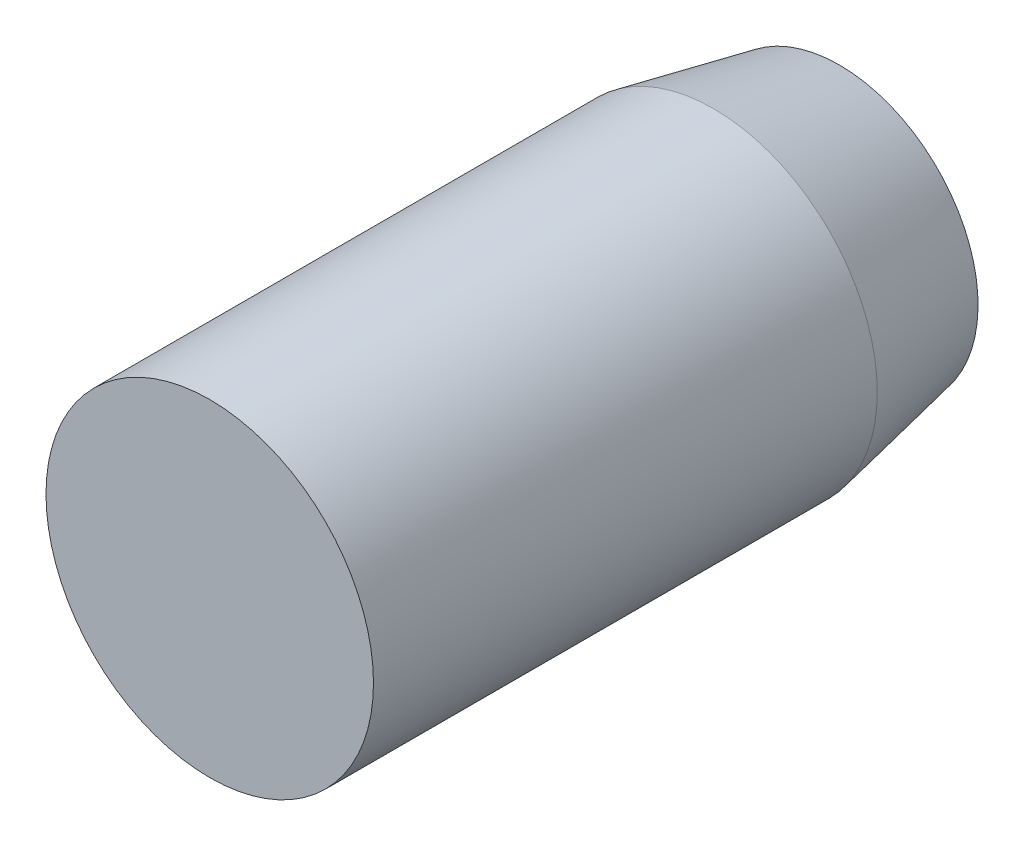
ISO-10303-21;
HEADER;
FILE_DESCRIPTION(('STEP AP214'),'2;1');
FILE_NAME('part.step','',(''),(''),'','','');
FILE_SCHEMA(('AUTOMOTIVE_DESIGN { 1 0 10303 214 1 1 1 1 }'));
ENDSEC;
DATA;
#1=APPLICATION_CONTEXT('core data for automotive mechanical design processes');
#2=APPLICATION_PROTOCOL_DEFINITION('international standard','automotive_design',2000,#1);
#3=PRODUCT_CONTEXT('',#1,'mechanical');
#4=PRODUCT('Part','Part','',(#3));
#5=PRODUCT_RELATED_PRODUCT_CATEGORY('part','',(#4));
#6=PRODUCT_DEFINITION_FORMATION('','',#4);
#7=PRODUCT_DEFINITION_CONTEXT('part definition',#1,'design');
#8=PRODUCT_DEFINITION('design','',#6,#7);
#9=PRODUCT_DEFINITION_SHAPE('','',#8);
#10=(LENGTH_UNIT() NAMED_UNIT(*) SI_UNIT(.MILLI.,.METRE.));
#11=(NAMED_UNIT(*) PLANE_ANGLE_UNIT() SI_UNIT($,.RADIAN.));
#12=(NAMED_UNIT(*) SI_UNIT($,.STERADIAN.) SOLID_ANGLE_UNIT());
#13=UNCERTAINTY_MEASURE_WITH_UNIT(LENGTH_MEASURE(1.E-05),#10,'distance_accuracy_value','');
#14=(GEOMETRIC_REPRESENTATION_CONTEXT(3) GLOBAL_UNCERTAINTY_ASSIGNED_CONTEXT((#13)) GLOBAL_UNIT_ASSIGNED_CONTEXT((#10,
#11,#12)) REPRESENTATION_CONTEXT('',''));
#15=CARTESIAN_POINT('',(0.,0.,0.));
#16=DIRECTION('',(0.,0.,1.));
#17=DIRECTION('',(1.,0.,0.));
#18=AXIS2_PLACEMENT_3D('',#15,#16,#17);
#19=CARTESIAN_POINT('',(0.,0.,0.));
#20=DIRECTION('',(0.,0.,1.));
#21=DIRECTION('',(0.,-1.,0.));
#22=AXIS2_PLACEMENT_3D('',#19,#20,#21);
#23=PLANE('',#22);
#24=CARTESIAN_POINT('',(0.,0.,0.));
#25=DIRECTION('',(0.,0.,-1.));
#26=DIRECTION('',(0.,1.,0.));
#27=AXIS2_PLACEMENT_3D('',#24,#25,#26);
#28=CIRCLE('',#27,6.5);
#29=CARTESIAN_POINT('',(0.,6.5,0.));
#30=VERTEX_POINT('',#29);
#31=EDGE_CURVE('E10',#30,#30,#28,.T.);
#32=ORIENTED_EDGE('',*,*,#31,.F.);
#33=EDGE_LOOP('',(#32));
#34=FACE_BOUND('',#33,.T.);
#35=ADVANCED_FACE('F32',(#34),#23,.T.);
#36=CARTESIAN_POINT('',(0.,0.,-25.));
#37=DIRECTION('',(0.,0.,-1.));
#38=DIRECTION('',(0.,1.,0.));
#39=AXIS2_PLACEMENT_3D('',#36,#37,#38);
#40=CYLINDRICAL_SURFACE('',#39,6.5);
#41=ORIENTED_EDGE('',*,*,#31,.T.);
#42=EDGE_LOOP('',(#41));
#43=FACE_BOUND('',#42,.T.);
#44=CARTESIAN_POINT('',(0.,0.,-20.));
#45=DIRECTION('',(0.,0.,-1.));
#46=DIRECTION('',(0.,1.,0.));
#47=AXIS2_PLACEMENT_3D('',#44,#45,#46);
#48=CIRCLE('',#47,6.5);
#49=CARTESIAN_POINT('',(0.,6.5,-20.));
#50=VERTEX_POINT('',#49);
#51=EDGE_CURVE('E38',#50,#50,#48,.T.);
#52=ORIENTED_EDGE('',*,*,#51,.F.);
#53=EDGE_LOOP('',(#52));
#54=FACE_BOUND('',#53,.T.);
#55=ADVANCED_FACE('F53',(#43,#54),#40,.T.);
#56=CARTESIAN_POINT('',(0.,0.,-25.));
#57=DIRECTION('',(0.,0.,1.));
#58=DIRECTION('',(0.,-1.,0.));
#59=AXIS2_PLACEMENT_3D('',#56,#57,#58);
#60=CONICAL_SURFACE('',#59,5.5,0.19739555984988);
#61=ORIENTED_EDGE('',*,*,#51,.T.);
#62=EDGE_LOOP('',(#61));
#63=FACE_BOUND('',#62,.T.);
#64=CARTESIAN_POINT('',(0.,0.,-25.));
#65=DIRECTION('',(0.,0.,-1.));
#66=DIRECTION('',(0.,1.,0.));
#67=AXIS2_PLACEMENT_3D('',#64,#65,#66);
#68=CIRCLE('',#67,5.5);
#69=CARTESIAN_POINT('',(0.,5.5,-25.));
#70=VERTEX_POINT('',#69);
#71=EDGE_CURVE('E42',#70,#70,#68,.T.);
#72=ORIENTED_EDGE('',*,*,#71,.F.);
#73=EDGE_LOOP('',(#72));
#74=FACE_BOUND('',#73,.T.);
#75=ADVANCED_FACE('F51',(#63,#74),#60,.T.);
#76=CARTESIAN_POINT('',(0.,5.5,-25.));
#77=DIRECTION('',(0.,0.,-1.));
#78=DIRECTION('',(0.,1.,0.));
#79=AXIS2_PLACEMENT_3D('',#76,#77,#78);
#80=PLANE('',#79);
#81=ORIENTED_EDGE('',*,*,#71,.T.);
#82=EDGE_LOOP('',(#81));
#83=FACE_BOUND('',#82,.T.);
#84=ADVANCED_FACE('F49',(#83),#80,.T.);
#85=CLOSED_SHELL('',(#35,#55,#75,#84));
#86=MANIFOLD_SOLID_BREP('B2',#85);
#87=ADVANCED_BREP_SHAPE_REPRESENTATION('',(#18,#86),#14);
#88=SHAPE_DEFINITION_REPRESENTATION(#9,#87);
ENDSEC;
END-ISO-10303-21;
